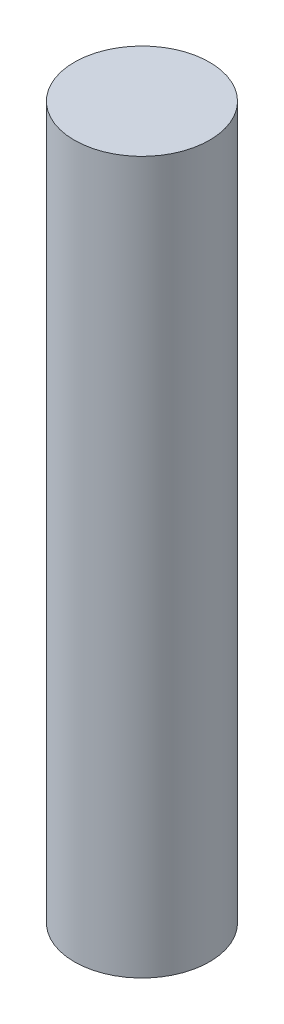
ISO-10303-21;
HEADER;
FILE_DESCRIPTION(('STEP AP214'),'2;1');
FILE_NAME('part.step','',(''),(''),'','','');
FILE_SCHEMA(('AUTOMOTIVE_DESIGN { 1 0 10303 214 1 1 1 1 }'));
ENDSEC;
DATA;
#1=APPLICATION_CONTEXT('core data for automotive mechanical design processes');
#2=APPLICATION_PROTOCOL_DEFINITION('international standard','automotive_design',2000,#1);
#3=PRODUCT_CONTEXT('',#1,'mechanical');
#4=PRODUCT('Part','Part','',(#3));
#5=PRODUCT_RELATED_PRODUCT_CATEGORY('part','',(#4));
#6=PRODUCT_DEFINITION_FORMATION('','',#4);
#7=PRODUCT_DEFINITION_CONTEXT('part definition',#1,'design');
#8=PRODUCT_DEFINITION('design','',#6,#7);
#9=PRODUCT_DEFINITION_SHAPE('','',#8);
#10=(LENGTH_UNIT() NAMED_UNIT(*) SI_UNIT(.MILLI.,.METRE.));
#11=(NAMED_UNIT(*) PLANE_ANGLE_UNIT() SI_UNIT($,.RADIAN.));
#12=(NAMED_UNIT(*) SI_UNIT($,.STERADIAN.) SOLID_ANGLE_UNIT());
#13=UNCERTAINTY_MEASURE_WITH_UNIT(LENGTH_MEASURE(1.E-05),#10,'distance_accuracy_value','');
#14=(GEOMETRIC_REPRESENTATION_CONTEXT(3) GLOBAL_UNCERTAINTY_ASSIGNED_CONTEXT((#13)) GLOBAL_UNIT_ASSIGNED_CONTEXT((#10,
#11,#12)) REPRESENTATION_CONTEXT('',''));
#15=CARTESIAN_POINT('',(0.,0.,0.));
#16=DIRECTION('',(0.,0.,1.));
#17=DIRECTION('',(1.,0.,0.));
#18=AXIS2_PLACEMENT_3D('',#15,#16,#17);
#19=CARTESIAN_POINT('',(1.94981043420037,50.8,0.248918830400485));
#20=DIRECTION('',(0.,-1.,0.));
#21=DIRECTION('',(0.,0.,-1.));
#22=AXIS2_PLACEMENT_3D('',#19,#20,#21);
#23=CYLINDRICAL_SURFACE('',#22,4.82599999999999);
#24=CARTESIAN_POINT('',(1.94981043420037,50.8,0.248918830400485));
#25=DIRECTION('',(0.,1.,0.));
#26=DIRECTION('',(0.,0.,1.));
#27=AXIS2_PLACEMENT_3D('',#24,#25,#26);
#28=CIRCLE('',#27,4.82599999999999);
#29=CARTESIAN_POINT('',(1.94981043420037,50.8,5.07491883040047));
#30=VERTEX_POINT('',#29);
#31=EDGE_CURVE('E10',#30,#30,#28,.T.);
#32=ORIENTED_EDGE('',*,*,#31,.F.);
#33=EDGE_LOOP('',(#32));
#34=FACE_BOUND('',#33,.T.);
#35=CARTESIAN_POINT('',(1.94981043420037,0.,0.248918830400485));
#36=DIRECTION('',(0.,1.,0.));
#37=DIRECTION('',(0.,0.,1.));
#38=AXIS2_PLACEMENT_3D('',#35,#36,#37);
#39=CIRCLE('',#38,4.82599999999999);
#40=CARTESIAN_POINT('',(1.94981043420037,0.,5.07491883040047));
#41=VERTEX_POINT('',#40);
#42=EDGE_CURVE('E37',#41,#41,#39,.T.);
#43=ORIENTED_EDGE('',*,*,#42,.T.);
#44=EDGE_LOOP('',(#43));
#45=FACE_BOUND('',#44,.T.);
#46=ADVANCED_FACE('F34',(#34,#45),#23,.T.);
#47=CARTESIAN_POINT('',(1.94981043420037,50.8,0.248918830400485));
#48=DIRECTION('',(0.,1.,0.));
#49=DIRECTION('',(0.,0.,1.));
#50=AXIS2_PLACEMENT_3D('',#47,#48,#49);
#51=PLANE('',#50);
#52=ORIENTED_EDGE('',*,*,#31,.T.);
#53=EDGE_LOOP('',(#52));
#54=FACE_BOUND('',#53,.T.);
#55=ADVANCED_FACE('F49',(#54),#51,.T.);
#56=CARTESIAN_POINT('',(1.94981043420037,0.,0.248918830400485));
#57=DIRECTION('',(0.,1.,0.));
#58=DIRECTION('',(0.,0.,1.));
#59=AXIS2_PLACEMENT_3D('',#56,#57,#58);
#60=PLANE('',#59);
#61=ORIENTED_EDGE('',*,*,#42,.F.);
#62=EDGE_LOOP('',(#61));
#63=FACE_BOUND('',#62,.T.);
#64=ADVANCED_FACE('F47',(#63),#60,.F.);
#65=CLOSED_SHELL('',(#46,#55,#64));
#66=MANIFOLD_SOLID_BREP('B2',#65);
#67=ADVANCED_BREP_SHAPE_REPRESENTATION('',(#18,#66),#14);
#68=SHAPE_DEFINITION_REPRESENTATION(#9,#67);
ENDSEC;
END-ISO-10303-21;
